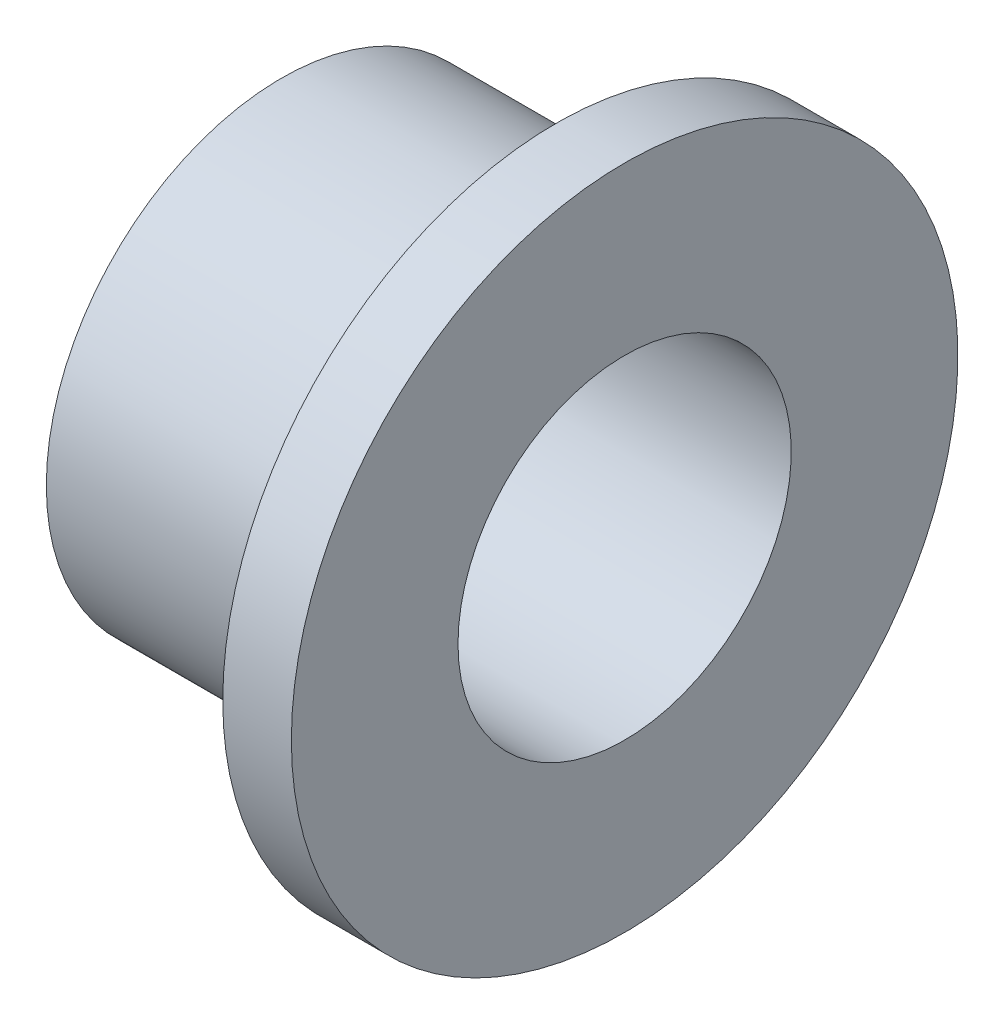
ISO-10303-21;
HEADER;
FILE_DESCRIPTION(('STEP AP214'),'2;1');
FILE_NAME('part.step','',(''),(''),'','','');
FILE_SCHEMA(('AUTOMOTIVE_DESIGN { 1 0 10303 214 1 1 1 1 }'));
ENDSEC;
DATA;
#1=APPLICATION_CONTEXT('core data for automotive mechanical design processes');
#2=APPLICATION_PROTOCOL_DEFINITION('international standard','automotive_design',2000,#1);
#3=PRODUCT_CONTEXT('',#1,'mechanical');
#4=PRODUCT('Part','Part','',(#3));
#5=PRODUCT_RELATED_PRODUCT_CATEGORY('part','',(#4));
#6=PRODUCT_DEFINITION_FORMATION('','',#4);
#7=PRODUCT_DEFINITION_CONTEXT('part definition',#1,'design');
#8=PRODUCT_DEFINITION('design','',#6,#7);
#9=PRODUCT_DEFINITION_SHAPE('','',#8);
#10=(LENGTH_UNIT() NAMED_UNIT(*) SI_UNIT(.MILLI.,.METRE.));
#11=(NAMED_UNIT(*) PLANE_ANGLE_UNIT() SI_UNIT($,.RADIAN.));
#12=(NAMED_UNIT(*) SI_UNIT($,.STERADIAN.) SOLID_ANGLE_UNIT());
#13=UNCERTAINTY_MEASURE_WITH_UNIT(LENGTH_MEASURE(1.E-05),#10,'distance_accuracy_value','');
#14=(GEOMETRIC_REPRESENTATION_CONTEXT(3) GLOBAL_UNCERTAINTY_ASSIGNED_CONTEXT((#13)) GLOBAL_UNIT_ASSIGNED_CONTEXT((#10,
#11,#12)) REPRESENTATION_CONTEXT('',''));
#15=CARTESIAN_POINT('',(0.,0.,0.));
#16=DIRECTION('',(0.,0.,1.));
#17=DIRECTION('',(1.,0.,0.));
#18=AXIS2_PLACEMENT_3D('',#15,#16,#17);
#19=CARTESIAN_POINT('',(-30.1744966442978,0.,17.));
#20=DIRECTION('',(-1.,0.,0.));
#21=DIRECTION('',(0.,0.,1.));
#22=AXIS2_PLACEMENT_3D('',#19,#20,#21);
#23=PLANE('',#22);
#24=CARTESIAN_POINT('',(-30.1744966442978,0.,0.));
#25=DIRECTION('',(-1.,0.,0.));
#26=DIRECTION('',(0.,0.,1.));
#27=AXIS2_PLACEMENT_3D('',#24,#25,#26);
#28=CIRCLE('',#27,24.);
#29=CARTESIAN_POINT('',(-30.1744966442978,0.,24.));
#30=VERTEX_POINT('',#29);
#31=EDGE_CURVE('E10',#30,#30,#28,.T.);
#32=ORIENTED_EDGE('',*,*,#31,.T.);
#33=EDGE_LOOP('',(#32));
#34=FACE_BOUND('',#33,.T.);
#35=CARTESIAN_POINT('',(-30.1744966442978,0.,0.));
#36=DIRECTION('',(-1.,0.,0.));
#37=DIRECTION('',(0.,0.,1.));
#38=AXIS2_PLACEMENT_3D('',#35,#36,#37);
#39=CIRCLE('',#38,17.);
#40=CARTESIAN_POINT('',(-30.1744966442978,0.,17.));
#41=VERTEX_POINT('',#40);
#42=EDGE_CURVE('E53',#41,#41,#39,.T.);
#43=ORIENTED_EDGE('',*,*,#42,.F.);
#44=EDGE_LOOP('',(#43));
#45=FACE_BOUND('',#44,.T.);
#46=ADVANCED_FACE('F31',(#34,#45),#23,.T.);
#47=CARTESIAN_POINT('',(-56.3758389261745,0.,0.));
#48=DIRECTION('',(-1.,0.,0.));
#49=DIRECTION('',(0.,0.,1.));
#50=AXIS2_PLACEMENT_3D('',#47,#48,#49);
#51=CYLINDRICAL_SURFACE('',#50,24.);
#52=CARTESIAN_POINT('',(-2.17449664429777,0.,0.));
#53=DIRECTION('',(-1.,0.,0.));
#54=DIRECTION('',(0.,0.,1.));
#55=AXIS2_PLACEMENT_3D('',#52,#53,#54);
#56=CIRCLE('',#55,24.);
#57=CARTESIAN_POINT('',(-2.17449664429777,0.,24.));
#58=VERTEX_POINT('',#57);
#59=EDGE_CURVE('E37',#58,#58,#56,.T.);
#60=ORIENTED_EDGE('',*,*,#59,.T.);
#61=EDGE_LOOP('',(#60));
#62=FACE_BOUND('',#61,.T.);
#63=ORIENTED_EDGE('',*,*,#31,.F.);
#64=EDGE_LOOP('',(#63));
#65=FACE_BOUND('',#64,.T.);
#66=ADVANCED_FACE('F61',(#62,#65),#51,.T.);
#67=CARTESIAN_POINT('',(-2.17449664429777,0.,24.));
#68=DIRECTION('',(-1.,0.,0.));
#69=DIRECTION('',(0.,0.,1.));
#70=AXIS2_PLACEMENT_3D('',#67,#68,#69);
#71=PLANE('',#70);
#72=CARTESIAN_POINT('',(-2.17449664429777,0.,0.));
#73=DIRECTION('',(-1.,0.,0.));
#74=DIRECTION('',(0.,0.,1.));
#75=AXIS2_PLACEMENT_3D('',#72,#73,#74);
#76=CIRCLE('',#75,34.);
#77=CARTESIAN_POINT('',(-2.17449664429777,0.,34.));
#78=VERTEX_POINT('',#77);
#79=EDGE_CURVE('E41',#78,#78,#76,.T.);
#80=ORIENTED_EDGE('',*,*,#79,.T.);
#81=EDGE_LOOP('',(#80));
#82=FACE_BOUND('',#81,.T.);
#83=ORIENTED_EDGE('',*,*,#59,.F.);
#84=EDGE_LOOP('',(#83));
#85=FACE_BOUND('',#84,.T.);
#86=ADVANCED_FACE('F65',(#82,#85),#71,.T.);
#87=CARTESIAN_POINT('',(-56.3758389261745,0.,0.));
#88=DIRECTION('',(-1.,0.,0.));
#89=DIRECTION('',(0.,0.,1.));
#90=AXIS2_PLACEMENT_3D('',#87,#88,#89);
#91=CYLINDRICAL_SURFACE('',#90,34.);
#92=CARTESIAN_POINT('',(4.82550335570223,0.,0.));
#93=DIRECTION('',(-1.,0.,0.));
#94=DIRECTION('',(0.,0.,1.));
#95=AXIS2_PLACEMENT_3D('',#92,#93,#94);
#96=CIRCLE('',#95,34.);
#97=CARTESIAN_POINT('',(4.82550335570223,0.,34.));
#98=VERTEX_POINT('',#97);
#99=EDGE_CURVE('E45',#98,#98,#96,.T.);
#100=ORIENTED_EDGE('',*,*,#99,.T.);
#101=EDGE_LOOP('',(#100));
#102=FACE_BOUND('',#101,.T.);
#103=ORIENTED_EDGE('',*,*,#79,.F.);
#104=EDGE_LOOP('',(#103));
#105=FACE_BOUND('',#104,.T.);
#106=ADVANCED_FACE('F69',(#102,#105),#91,.T.);
#107=CARTESIAN_POINT('',(4.82550335570224,0.,34.));
#108=DIRECTION('',(1.,0.,0.));
#109=DIRECTION('',(0.,0.,-1.));
#110=AXIS2_PLACEMENT_3D('',#107,#108,#109);
#111=PLANE('',#110);
#112=CARTESIAN_POINT('',(4.82550335570223,0.,0.));
#113=DIRECTION('',(-1.,0.,0.));
#114=DIRECTION('',(0.,0.,1.));
#115=AXIS2_PLACEMENT_3D('',#112,#113,#114);
#116=CIRCLE('',#115,17.);
#117=CARTESIAN_POINT('',(4.82550335570223,0.,17.));
#118=VERTEX_POINT('',#117);
#119=EDGE_CURVE('E50',#118,#118,#116,.T.);
#120=ORIENTED_EDGE('',*,*,#119,.T.);
#121=EDGE_LOOP('',(#120));
#122=FACE_BOUND('',#121,.T.);
#123=ORIENTED_EDGE('',*,*,#99,.F.);
#124=EDGE_LOOP('',(#123));
#125=FACE_BOUND('',#124,.T.);
#126=ADVANCED_FACE('F76',(#122,#125),#111,.T.);
#127=CARTESIAN_POINT('',(-56.3758389261745,0.,0.));
#128=DIRECTION('',(-1.,0.,0.));
#129=DIRECTION('',(0.,0.,1.));
#130=AXIS2_PLACEMENT_3D('',#127,#128,#129);
#131=CYLINDRICAL_SURFACE('',#130,17.);
#132=ORIENTED_EDGE('',*,*,#42,.T.);
#133=EDGE_LOOP('',(#132));
#134=FACE_BOUND('',#133,.T.);
#135=ORIENTED_EDGE('',*,*,#119,.F.);
#136=EDGE_LOOP('',(#135));
#137=FACE_BOUND('',#136,.T.);
#138=ADVANCED_FACE('F57',(#134,#137),#131,.F.);
#139=CLOSED_SHELL('',(#46,#66,#86,#106,#126,#138));
#140=MANIFOLD_SOLID_BREP('B2',#139);
#141=ADVANCED_BREP_SHAPE_REPRESENTATION('',(#18,#140),#14);
#142=SHAPE_DEFINITION_REPRESENTATION(#9,#141);
ENDSEC;
END-ISO-10303-21;
